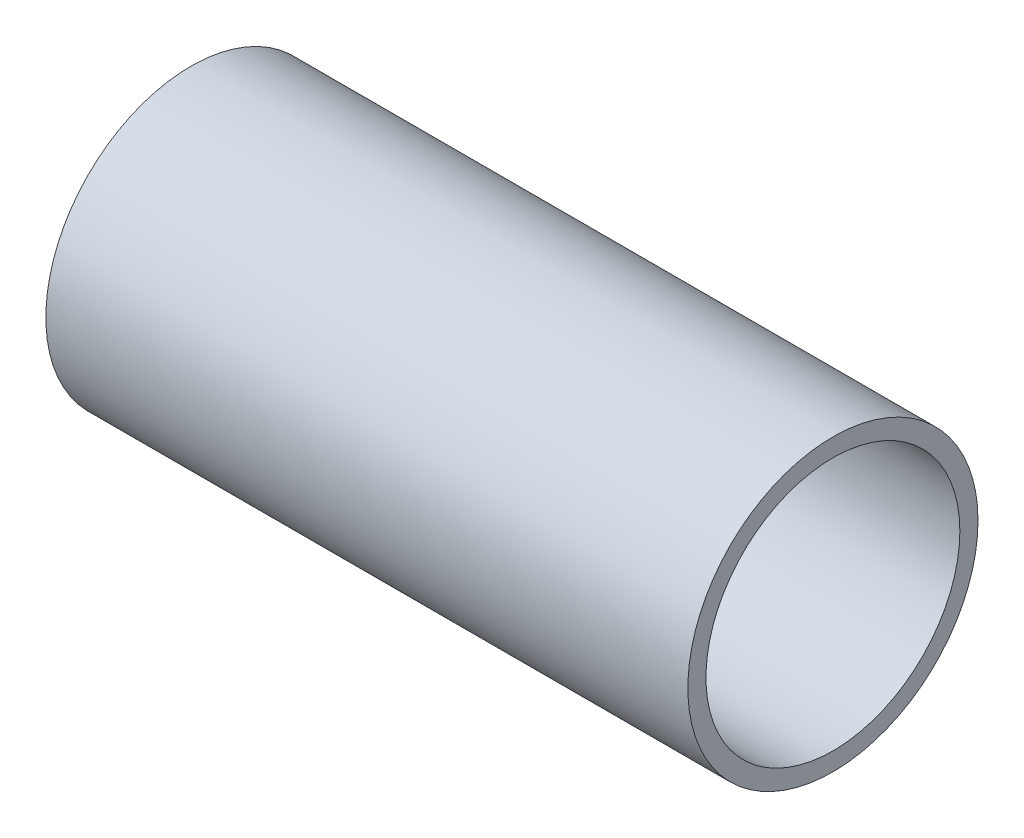
ISO-10303-21;
HEADER;
FILE_DESCRIPTION(('STEP AP214'),'2;1');
FILE_NAME('part.step','',(''),(''),'','','');
FILE_SCHEMA(('AUTOMOTIVE_DESIGN { 1 0 10303 214 1 1 1 1 }'));
ENDSEC;
DATA;
#1=APPLICATION_CONTEXT('core data for automotive mechanical design processes');
#2=APPLICATION_PROTOCOL_DEFINITION('international standard','automotive_design',2000,#1);
#3=PRODUCT_CONTEXT('',#1,'mechanical');
#4=PRODUCT('Part','Part','',(#3));
#5=PRODUCT_RELATED_PRODUCT_CATEGORY('part','',(#4));
#6=PRODUCT_DEFINITION_FORMATION('','',#4);
#7=PRODUCT_DEFINITION_CONTEXT('part definition',#1,'design');
#8=PRODUCT_DEFINITION('design','',#6,#7);
#9=PRODUCT_DEFINITION_SHAPE('','',#8);
#10=(LENGTH_UNIT() NAMED_UNIT(*) SI_UNIT(.MILLI.,.METRE.));
#11=(NAMED_UNIT(*) PLANE_ANGLE_UNIT() SI_UNIT($,.RADIAN.));
#12=(NAMED_UNIT(*) SI_UNIT($,.STERADIAN.) SOLID_ANGLE_UNIT());
#13=UNCERTAINTY_MEASURE_WITH_UNIT(LENGTH_MEASURE(1.E-05),#10,'distance_accuracy_value','');
#14=(GEOMETRIC_REPRESENTATION_CONTEXT(3) GLOBAL_UNCERTAINTY_ASSIGNED_CONTEXT((#13)) GLOBAL_UNIT_ASSIGNED_CONTEXT((#10,
#11,#12)) REPRESENTATION_CONTEXT('',''));
#15=CARTESIAN_POINT('',(0.,0.,0.));
#16=DIRECTION('',(0.,0.,1.));
#17=DIRECTION('',(1.,0.,0.));
#18=AXIS2_PLACEMENT_3D('',#15,#16,#17);
#19=CARTESIAN_POINT('',(35.4,0.,0.));
#20=DIRECTION('',(1.,0.,0.));
#21=DIRECTION('',(0.,0.,-1.));
#22=AXIS2_PLACEMENT_3D('',#19,#20,#21);
#23=PLANE('',#22);
#24=CARTESIAN_POINT('',(35.4,0.,0.));
#25=DIRECTION('',(1.,0.,0.));
#26=DIRECTION('',(0.,0.,-1.));
#27=AXIS2_PLACEMENT_3D('',#24,#25,#26);
#28=CIRCLE('',#27,8.);
#29=CARTESIAN_POINT('',(35.4,0.,-8.));
#30=VERTEX_POINT('',#29);
#31=EDGE_CURVE('E10',#30,#30,#28,.T.);
#32=ORIENTED_EDGE('',*,*,#31,.T.);
#33=EDGE_LOOP('',(#32));
#34=FACE_BOUND('',#33,.T.);
#35=CARTESIAN_POINT('',(35.4,0.,0.));
#36=DIRECTION('',(1.,0.,0.));
#37=DIRECTION('',(0.,0.,-1.));
#38=AXIS2_PLACEMENT_3D('',#35,#36,#37);
#39=CIRCLE('',#38,7.);
#40=CARTESIAN_POINT('',(35.4,0.,-7.));
#41=VERTEX_POINT('',#40);
#42=EDGE_CURVE('E44',#41,#41,#39,.T.);
#43=ORIENTED_EDGE('',*,*,#42,.F.);
#44=EDGE_LOOP('',(#43));
#45=FACE_BOUND('',#44,.T.);
#46=ADVANCED_FACE('F33',(#34,#45),#23,.T.);
#47=CARTESIAN_POINT('',(0.,0.,0.));
#48=DIRECTION('',(1.,0.,0.));
#49=DIRECTION('',(0.,0.,-1.));
#50=AXIS2_PLACEMENT_3D('',#47,#48,#49);
#51=PLANE('',#50);
#52=CARTESIAN_POINT('',(0.,0.,0.));
#53=DIRECTION('',(1.,0.,0.));
#54=DIRECTION('',(0.,0.,-1.));
#55=AXIS2_PLACEMENT_3D('',#52,#53,#54);
#56=CIRCLE('',#55,8.);
#57=CARTESIAN_POINT('',(0.,0.,-8.));
#58=VERTEX_POINT('',#57);
#59=EDGE_CURVE('E37',#58,#58,#56,.T.);
#60=ORIENTED_EDGE('',*,*,#59,.F.);
#61=EDGE_LOOP('',(#60));
#62=FACE_BOUND('',#61,.T.);
#63=CARTESIAN_POINT('',(0.,0.,0.));
#64=DIRECTION('',(1.,0.,0.));
#65=DIRECTION('',(0.,0.,-1.));
#66=AXIS2_PLACEMENT_3D('',#63,#64,#65);
#67=CIRCLE('',#66,7.);
#68=CARTESIAN_POINT('',(0.,0.,-7.));
#69=VERTEX_POINT('',#68);
#70=EDGE_CURVE('E46',#69,#69,#67,.T.);
#71=ORIENTED_EDGE('',*,*,#70,.T.);
#72=EDGE_LOOP('',(#71));
#73=FACE_BOUND('',#72,.T.);
#74=ADVANCED_FACE('F56',(#62,#73),#51,.F.);
#75=CARTESIAN_POINT('',(35.4,0.,0.));
#76=DIRECTION('',(-1.,0.,0.));
#77=DIRECTION('',(0.,0.,1.));
#78=AXIS2_PLACEMENT_3D('',#75,#76,#77);
#79=CYLINDRICAL_SURFACE('',#78,8.);
#80=ORIENTED_EDGE('',*,*,#31,.F.);
#81=EDGE_LOOP('',(#80));
#82=FACE_BOUND('',#81,.T.);
#83=ORIENTED_EDGE('',*,*,#59,.T.);
#84=EDGE_LOOP('',(#83));
#85=FACE_BOUND('',#84,.T.);
#86=ADVANCED_FACE('F35',(#82,#85),#79,.T.);
#87=CARTESIAN_POINT('',(35.4,0.,0.));
#88=DIRECTION('',(-1.,0.,0.));
#89=DIRECTION('',(0.,0.,1.));
#90=AXIS2_PLACEMENT_3D('',#87,#88,#89);
#91=CYLINDRICAL_SURFACE('',#90,7.);
#92=ORIENTED_EDGE('',*,*,#42,.T.);
#93=EDGE_LOOP('',(#92));
#94=FACE_BOUND('',#93,.T.);
#95=ORIENTED_EDGE('',*,*,#70,.F.);
#96=EDGE_LOOP('',(#95));
#97=FACE_BOUND('',#96,.T.);
#98=ADVANCED_FACE('F52',(#94,#97),#91,.F.);
#99=CLOSED_SHELL('',(#46,#74,#86,#98));
#100=MANIFOLD_SOLID_BREP('B2',#99);
#101=ADVANCED_BREP_SHAPE_REPRESENTATION('',(#18,#100),#14);
#102=SHAPE_DEFINITION_REPRESENTATION(#9,#101);
ENDSEC;
END-ISO-10303-21;
